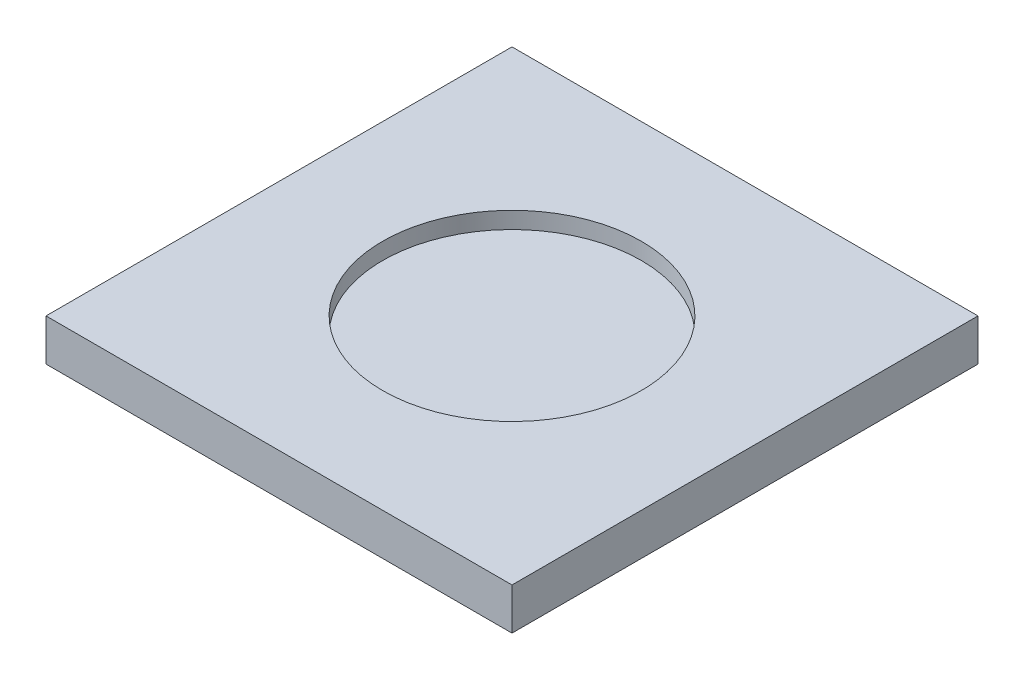
ISO-10303-21;
HEADER;
FILE_DESCRIPTION(('STEP AP214'),'2;1');
FILE_NAME('part.step','',(''),(''),'','','');
FILE_SCHEMA(('AUTOMOTIVE_DESIGN { 1 0 10303 214 1 1 1 1 }'));
ENDSEC;
DATA;
#1=APPLICATION_CONTEXT('core data for automotive mechanical design processes');
#2=APPLICATION_PROTOCOL_DEFINITION('international standard','automotive_design',2000,#1);
#3=PRODUCT_CONTEXT('',#1,'mechanical');
#4=PRODUCT('Part','Part','',(#3));
#5=PRODUCT_RELATED_PRODUCT_CATEGORY('part','',(#4));
#6=PRODUCT_DEFINITION_FORMATION('','',#4);
#7=PRODUCT_DEFINITION_CONTEXT('part definition',#1,'design');
#8=PRODUCT_DEFINITION('design','',#6,#7);
#9=PRODUCT_DEFINITION_SHAPE('','',#8);
#10=(LENGTH_UNIT() NAMED_UNIT(*) SI_UNIT(.MILLI.,.METRE.));
#11=(NAMED_UNIT(*) PLANE_ANGLE_UNIT() SI_UNIT($,.RADIAN.));
#12=(NAMED_UNIT(*) SI_UNIT($,.STERADIAN.) SOLID_ANGLE_UNIT());
#13=UNCERTAINTY_MEASURE_WITH_UNIT(LENGTH_MEASURE(1.E-05),#10,'distance_accuracy_value','');
#14=(GEOMETRIC_REPRESENTATION_CONTEXT(3) GLOBAL_UNCERTAINTY_ASSIGNED_CONTEXT((#13)) GLOBAL_UNIT_ASSIGNED_CONTEXT((#10,
#11,#12)) REPRESENTATION_CONTEXT('',''));
#15=CARTESIAN_POINT('',(0.,0.,0.));
#16=DIRECTION('',(0.,0.,1.));
#17=DIRECTION('',(1.,0.,0.));
#18=AXIS2_PLACEMENT_3D('',#15,#16,#17);
#19=CARTESIAN_POINT('',(-44.1492537313433,5.,28.699004975091));
#20=DIRECTION('',(1.,0.,0.));
#21=DIRECTION('',(0.,0.,-1.));
#22=AXIS2_PLACEMENT_3D('',#19,#20,#21);
#23=PLANE('',#22);
#24=DIRECTION('',(0.,0.,1.));
#25=VECTOR('',#24,1.);
#26=CARTESIAN_POINT('',(-44.1492537313433,0.,28.699004975091));
#27=LINE('',#26,#25);
#28=CARTESIAN_POINT('',(-44.1492537313433,0.,-27.134328358209));
#29=VERTEX_POINT('',#28);
#30=CARTESIAN_POINT('',(-44.1492537313433,0.,28.699004975091));
#31=VERTEX_POINT('',#30);
#32=EDGE_CURVE('E96',#29,#31,#27,.T.);
#33=ORIENTED_EDGE('',*,*,#32,.T.);
#34=DIRECTION('',(0.,-1.,0.));
#35=VECTOR('',#34,1.);
#36=CARTESIAN_POINT('',(-44.1492537313433,5.,28.699004975091));
#37=LINE('',#36,#35);
#38=CARTESIAN_POINT('',(-44.1492537313433,5.,28.699004975091));
#39=VERTEX_POINT('',#38);
#40=EDGE_CURVE('E11',#39,#31,#37,.T.);
#41=ORIENTED_EDGE('',*,*,#40,.F.);
#42=DIRECTION('',(0.,0.,1.));
#43=VECTOR('',#42,1.);
#44=CARTESIAN_POINT('',(-44.1492537313433,5.,28.699004975091));
#45=LINE('',#44,#43);
#46=CARTESIAN_POINT('',(-44.1492537313433,5.,-27.134328358209));
#47=VERTEX_POINT('',#46);
#48=EDGE_CURVE('E84',#47,#39,#45,.T.);
#49=ORIENTED_EDGE('',*,*,#48,.F.);
#50=DIRECTION('',(0.,-1.,0.));
#51=VECTOR('',#50,1.);
#52=CARTESIAN_POINT('',(-44.1492537313433,5.,-27.134328358209));
#53=LINE('',#52,#51);
#54=EDGE_CURVE('E92',#47,#29,#53,.T.);
#55=ORIENTED_EDGE('',*,*,#54,.T.);
#56=EDGE_LOOP('',(#33,#41,#49,#55));
#57=FACE_BOUND('',#56,.T.);
#58=ADVANCED_FACE('F33',(#57),#23,.F.);
#59=CARTESIAN_POINT('',(-44.1492537313433,5.,28.699004975091));
#60=DIRECTION('',(0.,0.,-1.));
#61=DIRECTION('',(-1.,0.,0.));
#62=AXIS2_PLACEMENT_3D('',#59,#60,#61);
#63=PLANE('',#62);
#64=DIRECTION('',(1.,0.,0.));
#65=VECTOR('',#64,1.);
#66=CARTESIAN_POINT('',(-44.1492537313433,0.,28.699004975091));
#67=LINE('',#66,#65);
#68=CARTESIAN_POINT('',(11.6840796019567,0.,28.699004975091));
#69=VERTEX_POINT('',#68);
#70=EDGE_CURVE('E88',#31,#69,#67,.T.);
#71=ORIENTED_EDGE('',*,*,#70,.T.);
#72=DIRECTION('',(0.,-1.,0.));
#73=VECTOR('',#72,1.);
#74=CARTESIAN_POINT('',(11.6840796019567,5.,28.699004975091));
#75=LINE('',#74,#73);
#76=CARTESIAN_POINT('',(11.6840796019567,5.,28.699004975091));
#77=VERTEX_POINT('',#76);
#78=EDGE_CURVE('E41',#77,#69,#75,.T.);
#79=ORIENTED_EDGE('',*,*,#78,.F.);
#80=DIRECTION('',(1.,0.,0.));
#81=VECTOR('',#80,1.);
#82=CARTESIAN_POINT('',(-44.1492537313433,5.,28.699004975091));
#83=LINE('',#82,#81);
#84=EDGE_CURVE('E79',#39,#77,#83,.T.);
#85=ORIENTED_EDGE('',*,*,#84,.F.);
#86=ORIENTED_EDGE('',*,*,#40,.T.);
#87=EDGE_LOOP('',(#71,#79,#85,#86));
#88=FACE_BOUND('',#87,.T.);
#89=ADVANCED_FACE('F87',(#88),#63,.F.);
#90=CARTESIAN_POINT('',(11.6840796019567,5.,28.699004975091));
#91=DIRECTION('',(-1.,0.,0.));
#92=DIRECTION('',(0.,0.,1.));
#93=AXIS2_PLACEMENT_3D('',#90,#91,#92);
#94=PLANE('',#93);
#95=DIRECTION('',(0.,0.,-1.));
#96=VECTOR('',#95,1.);
#97=CARTESIAN_POINT('',(11.6840796019567,0.,28.699004975091));
#98=LINE('',#97,#96);
#99=CARTESIAN_POINT('',(11.6840796019567,0.,-27.134328358209));
#100=VERTEX_POINT('',#99);
#101=EDGE_CURVE('E66',#69,#100,#98,.T.);
#102=ORIENTED_EDGE('',*,*,#101,.T.);
#103=DIRECTION('',(0.,-1.,0.));
#104=VECTOR('',#103,1.);
#105=CARTESIAN_POINT('',(11.6840796019567,5.,-27.134328358209));
#106=LINE('',#105,#104);
#107=CARTESIAN_POINT('',(11.6840796019567,5.,-27.134328358209));
#108=VERTEX_POINT('',#107);
#109=EDGE_CURVE('E89',#108,#100,#106,.T.);
#110=ORIENTED_EDGE('',*,*,#109,.F.);
#111=DIRECTION('',(0.,0.,-1.));
#112=VECTOR('',#111,1.);
#113=CARTESIAN_POINT('',(11.6840796019567,5.,28.699004975091));
#114=LINE('',#113,#112);
#115=EDGE_CURVE('E82',#77,#108,#114,.T.);
#116=ORIENTED_EDGE('',*,*,#115,.F.);
#117=ORIENTED_EDGE('',*,*,#78,.T.);
#118=EDGE_LOOP('',(#102,#110,#116,#117));
#119=FACE_BOUND('',#118,.T.);
#120=ADVANCED_FACE('F90',(#119),#94,.F.);
#121=CARTESIAN_POINT('',(-44.1492537313433,5.,-27.134328358209));
#122=DIRECTION('',(0.,0.,1.));
#123=DIRECTION('',(1.,0.,0.));
#124=AXIS2_PLACEMENT_3D('',#121,#122,#123);
#125=PLANE('',#124);
#126=DIRECTION('',(-1.,0.,0.));
#127=VECTOR('',#126,1.);
#128=CARTESIAN_POINT('',(-44.1492537313433,0.,-27.134328358209));
#129=LINE('',#128,#127);
#130=EDGE_CURVE('E72',#100,#29,#129,.T.);
#131=ORIENTED_EDGE('',*,*,#130,.T.);
#132=ORIENTED_EDGE('',*,*,#54,.F.);
#133=DIRECTION('',(-1.,0.,0.));
#134=VECTOR('',#133,1.);
#135=CARTESIAN_POINT('',(-44.1492537313433,5.,-27.134328358209));
#136=LINE('',#135,#134);
#137=EDGE_CURVE('E49',#108,#47,#136,.T.);
#138=ORIENTED_EDGE('',*,*,#137,.F.);
#139=ORIENTED_EDGE('',*,*,#109,.T.);
#140=EDGE_LOOP('',(#131,#132,#138,#139));
#141=FACE_BOUND('',#140,.T.);
#142=ADVANCED_FACE('F104',(#141),#125,.F.);
#143=CARTESIAN_POINT('',(0.,5.,0.));
#144=DIRECTION('',(0.,-1.,0.));
#145=DIRECTION('',(0.,0.,-1.));
#146=AXIS2_PLACEMENT_3D('',#143,#144,#145);
#147=PLANE('',#146);
#148=CARTESIAN_POINT('',(-16.2325870646933,5.,0.78233830844103));
#149=DIRECTION('',(0.,1.,0.));
#150=DIRECTION('',(0.,0.,1.));
#151=AXIS2_PLACEMENT_3D('',#148,#149,#150);
#152=CIRCLE('',#151,15.5);
#153=CARTESIAN_POINT('',(-16.2325870646933,5.,16.282338308441));
#154=VERTEX_POINT('',#153);
#155=EDGE_CURVE('E110',#154,#154,#152,.T.);
#156=ORIENTED_EDGE('',*,*,#155,.F.);
#157=EDGE_LOOP('',(#156));
#158=FACE_BOUND('',#157,.T.);
#159=ORIENTED_EDGE('',*,*,#48,.T.);
#160=ORIENTED_EDGE('',*,*,#84,.T.);
#161=ORIENTED_EDGE('',*,*,#115,.T.);
#162=ORIENTED_EDGE('',*,*,#137,.T.);
#163=EDGE_LOOP('',(#159,#160,#161,#162));
#164=FACE_BOUND('',#163,.T.);
#165=ADVANCED_FACE('F80',(#158,#164),#147,.F.);
#166=CARTESIAN_POINT('',(0.,0.,0.));
#167=DIRECTION('',(0.,-1.,0.));
#168=DIRECTION('',(0.,0.,-1.));
#169=AXIS2_PLACEMENT_3D('',#166,#167,#168);
#170=PLANE('',#169);
#171=ORIENTED_EDGE('',*,*,#32,.F.);
#172=ORIENTED_EDGE('',*,*,#130,.F.);
#173=ORIENTED_EDGE('',*,*,#101,.F.);
#174=ORIENTED_EDGE('',*,*,#70,.F.);
#175=EDGE_LOOP('',(#171,#172,#173,#174));
#176=FACE_BOUND('',#175,.T.);
#177=ADVANCED_FACE('F107',(#176),#170,.T.);
#178=CARTESIAN_POINT('',(-16.2325870646933,3.,0.78233830844103));
#179=DIRECTION('',(0.,1.,0.));
#180=DIRECTION('',(0.,0.,1.));
#181=AXIS2_PLACEMENT_3D('',#178,#179,#180);
#182=CYLINDRICAL_SURFACE('',#181,15.5);
#183=CARTESIAN_POINT('',(-16.2325870646933,3.,0.78233830844103));
#184=DIRECTION('',(0.,1.,0.));
#185=DIRECTION('',(0.,0.,1.));
#186=AXIS2_PLACEMENT_3D('',#183,#184,#185);
#187=CIRCLE('',#186,15.5);
#188=CARTESIAN_POINT('',(-16.2325870646933,3.,16.282338308441));
#189=VERTEX_POINT('',#188);
#190=EDGE_CURVE('E99',#189,#189,#187,.T.);
#191=ORIENTED_EDGE('',*,*,#190,.F.);
#192=EDGE_LOOP('',(#191));
#193=FACE_BOUND('',#192,.T.);
#194=ORIENTED_EDGE('',*,*,#155,.T.);
#195=EDGE_LOOP('',(#194));
#196=FACE_BOUND('',#195,.T.);
#197=ADVANCED_FACE('F118',(#193,#196),#182,.F.);
#198=CARTESIAN_POINT('',(-16.2325870646933,3.,0.78233830844103));
#199=DIRECTION('',(0.,1.,0.));
#200=DIRECTION('',(0.,0.,1.));
#201=AXIS2_PLACEMENT_3D('',#198,#199,#200);
#202=PLANE('',#201);
#203=ORIENTED_EDGE('',*,*,#190,.T.);
#204=EDGE_LOOP('',(#203));
#205=FACE_BOUND('',#204,.T.);
#206=ADVANCED_FACE('F116',(#205),#202,.T.);
#207=CLOSED_SHELL('',(#58,#89,#120,#142,#165,#177,#197,#206));
#208=MANIFOLD_SOLID_BREP('B2',#207);
#209=ADVANCED_BREP_SHAPE_REPRESENTATION('',(#18,#208),#14);
#210=SHAPE_DEFINITION_REPRESENTATION(#9,#209);
ENDSEC;
END-ISO-10303-21;
